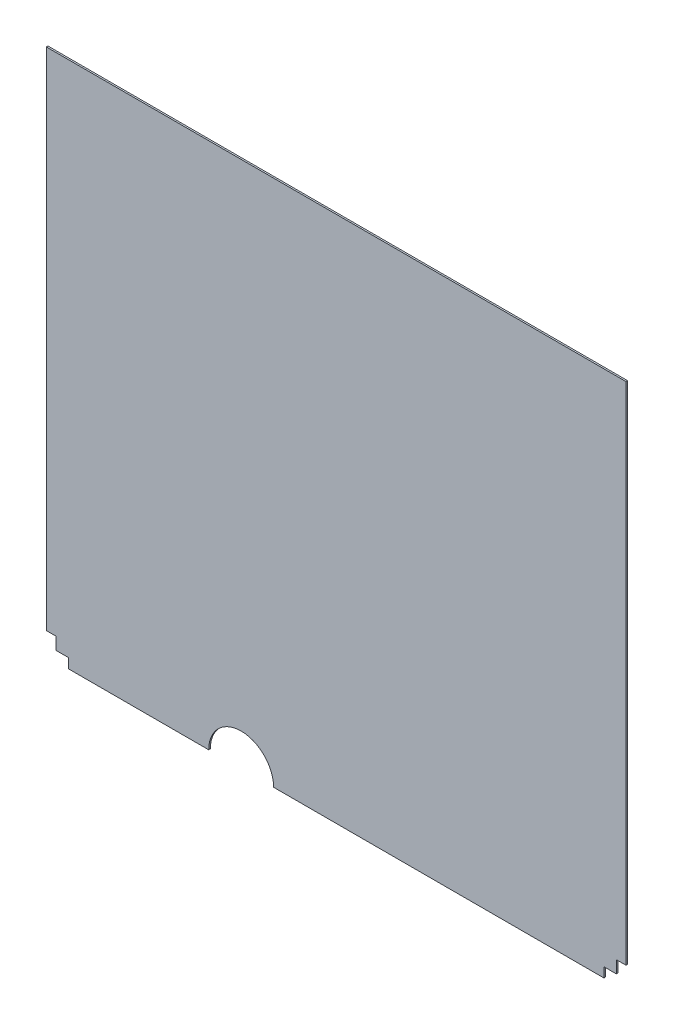
ISO-10303-21;
HEADER;
FILE_DESCRIPTION(('STEP AP214'),'2;1');
FILE_NAME('part.step','',(''),(''),'','','');
FILE_SCHEMA(('AUTOMOTIVE_DESIGN { 1 0 10303 214 1 1 1 1 }'));
ENDSEC;
DATA;
#1=APPLICATION_CONTEXT('core data for automotive mechanical design processes');
#2=APPLICATION_PROTOCOL_DEFINITION('international standard','automotive_design',2000,#1);
#3=PRODUCT_CONTEXT('',#1,'mechanical');
#4=PRODUCT('Part','Part','',(#3));
#5=PRODUCT_RELATED_PRODUCT_CATEGORY('part','',(#4));
#6=PRODUCT_DEFINITION_FORMATION('','',#4);
#7=PRODUCT_DEFINITION_CONTEXT('part definition',#1,'design');
#8=PRODUCT_DEFINITION('design','',#6,#7);
#9=PRODUCT_DEFINITION_SHAPE('','',#8);
#10=(LENGTH_UNIT() NAMED_UNIT(*) SI_UNIT(.MILLI.,.METRE.));
#11=(NAMED_UNIT(*) PLANE_ANGLE_UNIT() SI_UNIT($,.RADIAN.));
#12=(NAMED_UNIT(*) SI_UNIT($,.STERADIAN.) SOLID_ANGLE_UNIT());
#13=UNCERTAINTY_MEASURE_WITH_UNIT(LENGTH_MEASURE(1.E-05),#10,'distance_accuracy_value','');
#14=(GEOMETRIC_REPRESENTATION_CONTEXT(3) GLOBAL_UNCERTAINTY_ASSIGNED_CONTEXT((#13)) GLOBAL_UNIT_ASSIGNED_CONTEXT((#10,
#11,#12)) REPRESENTATION_CONTEXT('',''));
#15=CARTESIAN_POINT('',(0.,0.,0.));
#16=DIRECTION('',(0.,0.,1.));
#17=DIRECTION('',(1.,0.,0.));
#18=AXIS2_PLACEMENT_3D('',#15,#16,#17);
#19=CARTESIAN_POINT('',(304.8,0.,2.54));
#20=DIRECTION('',(0.,0.,-1.));
#21=DIRECTION('',(-1.,0.,0.));
#22=AXIS2_PLACEMENT_3D('',#19,#20,#21);
#23=CYLINDRICAL_SURFACE('',#22,50.8);
#24=CARTESIAN_POINT('',(304.8,0.,0.));
#25=DIRECTION('',(0.,0.,1.));
#26=DIRECTION('',(1.,0.,0.));
#27=AXIS2_PLACEMENT_3D('',#24,#25,#26);
#28=CIRCLE('',#27,50.8);
#29=CARTESIAN_POINT('',(355.6,0.,0.));
#30=VERTEX_POINT('',#29);
#31=CARTESIAN_POINT('',(254.,0.,0.));
#32=VERTEX_POINT('',#31);
#33=EDGE_CURVE('E182',#30,#32,#28,.T.);
#34=ORIENTED_EDGE('',*,*,#33,.F.);
#35=DIRECTION('',(0.,0.,-1.));
#36=VECTOR('',#35,1.);
#37=CARTESIAN_POINT('',(355.6,0.,2.54));
#38=LINE('',#37,#36);
#39=CARTESIAN_POINT('',(355.6,0.,2.54));
#40=VERTEX_POINT('',#39);
#41=EDGE_CURVE('E11',#40,#30,#38,.T.);
#42=ORIENTED_EDGE('',*,*,#41,.F.);
#43=CARTESIAN_POINT('',(304.8,0.,2.54));
#44=DIRECTION('',(0.,0.,1.));
#45=DIRECTION('',(1.,0.,0.));
#46=AXIS2_PLACEMENT_3D('',#43,#44,#45);
#47=CIRCLE('',#46,50.8);
#48=CARTESIAN_POINT('',(254.,0.,2.54));
#49=VERTEX_POINT('',#48);
#50=EDGE_CURVE('E287',#40,#49,#47,.T.);
#51=ORIENTED_EDGE('',*,*,#50,.T.);
#52=DIRECTION('',(0.,0.,-1.));
#53=VECTOR('',#52,1.);
#54=CARTESIAN_POINT('',(254.,0.,2.54));
#55=LINE('',#54,#53);
#56=EDGE_CURVE('E117',#49,#32,#55,.T.);
#57=ORIENTED_EDGE('',*,*,#56,.T.);
#58=EDGE_LOOP('',(#34,#42,#51,#57));
#59=FACE_BOUND('',#58,.T.);
#60=ADVANCED_FACE('F47',(#59),#23,.F.);
#61=CARTESIAN_POINT('',(0.,0.,2.54));
#62=DIRECTION('',(0.,1.,0.));
#63=DIRECTION('',(0.,0.,1.));
#64=AXIS2_PLACEMENT_3D('',#61,#62,#63);
#65=PLANE('',#64);
#66=DIRECTION('',(1.,0.,0.));
#67=VECTOR('',#66,1.);
#68=CARTESIAN_POINT('',(0.,0.,0.));
#69=LINE('',#68,#67);
#70=CARTESIAN_POINT('',(872.45698,0.,0.));
#71=VERTEX_POINT('',#70);
#72=EDGE_CURVE('E186',#30,#71,#69,.T.);
#73=ORIENTED_EDGE('',*,*,#72,.T.);
#74=DIRECTION('',(0.,0.,-1.));
#75=VECTOR('',#74,1.);
#76=CARTESIAN_POINT('',(872.45698,0.,2.54));
#77=LINE('',#76,#75);
#78=CARTESIAN_POINT('',(872.45698,0.,2.54));
#79=VERTEX_POINT('',#78);
#80=EDGE_CURVE('E56',#79,#71,#77,.T.);
#81=ORIENTED_EDGE('',*,*,#80,.F.);
#82=DIRECTION('',(1.,0.,0.));
#83=VECTOR('',#82,1.);
#84=CARTESIAN_POINT('',(0.,0.,2.54));
#85=LINE('',#84,#83);
#86=EDGE_CURVE('E179',#40,#79,#85,.T.);
#87=ORIENTED_EDGE('',*,*,#86,.F.);
#88=ORIENTED_EDGE('',*,*,#41,.T.);
#89=EDGE_LOOP('',(#73,#81,#87,#88));
#90=FACE_BOUND('',#89,.T.);
#91=ADVANCED_FACE('F269',(#90),#65,.F.);
#92=CARTESIAN_POINT('',(872.45698,0.,2.54));
#93=DIRECTION('',(1.,0.,0.));
#94=DIRECTION('',(0.,0.,-1.));
#95=AXIS2_PLACEMENT_3D('',#92,#93,#94);
#96=PLANE('',#95);
#97=DIRECTION('',(0.,-1.,0.));
#98=VECTOR('',#97,1.);
#99=CARTESIAN_POINT('',(872.45698,0.,0.));
#100=LINE('',#99,#98);
#101=CARTESIAN_POINT('',(872.45698,15.24,0.));
#102=VERTEX_POINT('',#101);
#103=EDGE_CURVE('E190',#102,#71,#100,.T.);
#104=ORIENTED_EDGE('',*,*,#103,.F.);
#105=DIRECTION('',(0.,0.,-1.));
#106=VECTOR('',#105,1.);
#107=CARTESIAN_POINT('',(872.45698,15.24,2.54));
#108=LINE('',#107,#106);
#109=CARTESIAN_POINT('',(872.45698,15.24,2.54));
#110=VERTEX_POINT('',#109);
#111=EDGE_CURVE('E257',#110,#102,#108,.T.);
#112=ORIENTED_EDGE('',*,*,#111,.F.);
#113=DIRECTION('',(0.,-1.,0.));
#114=VECTOR('',#113,1.);
#115=CARTESIAN_POINT('',(872.45698,0.,2.54));
#116=LINE('',#115,#114);
#117=EDGE_CURVE('E266',#110,#79,#116,.T.);
#118=ORIENTED_EDGE('',*,*,#117,.T.);
#119=ORIENTED_EDGE('',*,*,#80,.T.);
#120=EDGE_LOOP('',(#104,#112,#118,#119));
#121=FACE_BOUND('',#120,.T.);
#122=ADVANCED_FACE('F264',(#121),#96,.T.);
#123=CARTESIAN_POINT('',(0.,15.2399999999999,2.54));
#124=DIRECTION('',(0.,-1.,0.));
#125=DIRECTION('',(1.,0.,0.));
#126=AXIS2_PLACEMENT_3D('',#123,#124,#125);
#127=PLANE('',#126);
#128=DIRECTION('',(-1.,0.,0.));
#129=VECTOR('',#128,1.);
#130=CARTESIAN_POINT('',(0.,15.2399999999999,0.));
#131=LINE('',#130,#129);
#132=CARTESIAN_POINT('',(891.76098,15.24,0.));
#133=VERTEX_POINT('',#132);
#134=EDGE_CURVE('E195',#133,#102,#131,.T.);
#135=ORIENTED_EDGE('',*,*,#134,.F.);
#136=DIRECTION('',(0.,0.,-1.));
#137=VECTOR('',#136,1.);
#138=CARTESIAN_POINT('',(891.76098,15.24,2.54));
#139=LINE('',#138,#137);
#140=CARTESIAN_POINT('',(891.76098,15.24,2.54));
#141=VERTEX_POINT('',#140);
#142=EDGE_CURVE('E254',#141,#133,#139,.T.);
#143=ORIENTED_EDGE('',*,*,#142,.F.);
#144=DIRECTION('',(-1.,0.,0.));
#145=VECTOR('',#144,1.);
#146=CARTESIAN_POINT('',(0.,15.2399999999999,2.54));
#147=LINE('',#146,#145);
#148=EDGE_CURVE('E278',#141,#110,#147,.T.);
#149=ORIENTED_EDGE('',*,*,#148,.T.);
#150=ORIENTED_EDGE('',*,*,#111,.T.);
#151=EDGE_LOOP('',(#135,#143,#149,#150));
#152=FACE_BOUND('',#151,.T.);
#153=ADVANCED_FACE('F275',(#152),#127,.T.);
#154=CARTESIAN_POINT('',(891.76098,0.,2.54));
#155=DIRECTION('',(1.,0.,0.));
#156=DIRECTION('',(0.,0.,-1.));
#157=AXIS2_PLACEMENT_3D('',#154,#155,#156);
#158=PLANE('',#157);
#159=DIRECTION('',(0.,-1.,0.));
#160=VECTOR('',#159,1.);
#161=CARTESIAN_POINT('',(891.76098,0.,0.));
#162=LINE('',#161,#160);
#163=CARTESIAN_POINT('',(891.76098,34.544,0.));
#164=VERTEX_POINT('',#163);
#165=EDGE_CURVE('E199',#164,#133,#162,.T.);
#166=ORIENTED_EDGE('',*,*,#165,.F.);
#167=DIRECTION('',(0.,0.,-1.));
#168=VECTOR('',#167,1.);
#169=CARTESIAN_POINT('',(891.76098,34.544,2.54));
#170=LINE('',#169,#168);
#171=CARTESIAN_POINT('',(891.76098,34.544,2.54));
#172=VERTEX_POINT('',#171);
#173=EDGE_CURVE('E251',#172,#164,#170,.T.);
#174=ORIENTED_EDGE('',*,*,#173,.F.);
#175=DIRECTION('',(0.,-1.,0.));
#176=VECTOR('',#175,1.);
#177=CARTESIAN_POINT('',(891.76098,0.,2.54));
#178=LINE('',#177,#176);
#179=EDGE_CURVE('E285',#172,#141,#178,.T.);
#180=ORIENTED_EDGE('',*,*,#179,.T.);
#181=ORIENTED_EDGE('',*,*,#142,.T.);
#182=EDGE_LOOP('',(#166,#174,#180,#181));
#183=FACE_BOUND('',#182,.T.);
#184=ADVANCED_FACE('F365',(#183),#158,.T.);
#185=CARTESIAN_POINT('',(0.,34.5439999999996,2.54));
#186=DIRECTION('',(0.,-1.,0.));
#187=DIRECTION('',(1.,0.,0.));
#188=AXIS2_PLACEMENT_3D('',#185,#186,#187);
#189=PLANE('',#188);
#190=DIRECTION('',(-1.,0.,0.));
#191=VECTOR('',#190,1.);
#192=CARTESIAN_POINT('',(0.,34.5439999999996,0.));
#193=LINE('',#192,#191);
#194=CARTESIAN_POINT('',(907.00098,34.544,0.));
#195=VERTEX_POINT('',#194);
#196=EDGE_CURVE('E203',#195,#164,#193,.T.);
#197=ORIENTED_EDGE('',*,*,#196,.F.);
#198=DIRECTION('',(0.,0.,-1.));
#199=VECTOR('',#198,1.);
#200=CARTESIAN_POINT('',(907.00098,34.544,2.54));
#201=LINE('',#200,#199);
#202=CARTESIAN_POINT('',(907.00098,34.544,2.54));
#203=VERTEX_POINT('',#202);
#204=EDGE_CURVE('E248',#203,#195,#201,.T.);
#205=ORIENTED_EDGE('',*,*,#204,.F.);
#206=DIRECTION('',(-1.,0.,0.));
#207=VECTOR('',#206,1.);
#208=CARTESIAN_POINT('',(0.,34.5439999999996,2.54));
#209=LINE('',#208,#207);
#210=EDGE_CURVE('E292',#203,#172,#209,.T.);
#211=ORIENTED_EDGE('',*,*,#210,.T.);
#212=ORIENTED_EDGE('',*,*,#173,.T.);
#213=EDGE_LOOP('',(#197,#205,#211,#212));
#214=FACE_BOUND('',#213,.T.);
#215=ADVANCED_FACE('F361',(#214),#189,.T.);
#216=CARTESIAN_POINT('',(907.00098,0.,2.54));
#217=DIRECTION('',(-1.,0.,0.));
#218=DIRECTION('',(0.,0.,1.));
#219=AXIS2_PLACEMENT_3D('',#216,#217,#218);
#220=PLANE('',#219);
#221=DIRECTION('',(0.,1.,0.));
#222=VECTOR('',#221,1.);
#223=CARTESIAN_POINT('',(907.00098,0.,0.));
#224=LINE('',#223,#222);
#225=CARTESIAN_POINT('',(907.00098,825.5,0.));
#226=VERTEX_POINT('',#225);
#227=EDGE_CURVE('E207',#195,#226,#224,.T.);
#228=ORIENTED_EDGE('',*,*,#227,.T.);
#229=DIRECTION('',(0.,0.,-1.));
#230=VECTOR('',#229,1.);
#231=CARTESIAN_POINT('',(907.00098,825.5,2.54));
#232=LINE('',#231,#230);
#233=CARTESIAN_POINT('',(907.00098,825.5,2.54));
#234=VERTEX_POINT('',#233);
#235=EDGE_CURVE('E245',#234,#226,#232,.T.);
#236=ORIENTED_EDGE('',*,*,#235,.F.);
#237=DIRECTION('',(0.,1.,0.));
#238=VECTOR('',#237,1.);
#239=CARTESIAN_POINT('',(907.00098,0.,2.54));
#240=LINE('',#239,#238);
#241=EDGE_CURVE('E296',#203,#234,#240,.T.);
#242=ORIENTED_EDGE('',*,*,#241,.F.);
#243=ORIENTED_EDGE('',*,*,#204,.T.);
#244=EDGE_LOOP('',(#228,#236,#242,#243));
#245=FACE_BOUND('',#244,.T.);
#246=ADVANCED_FACE('F357',(#245),#220,.F.);
#247=CARTESIAN_POINT('',(0.,825.5,2.54));
#248=DIRECTION('',(0.,1.,0.));
#249=DIRECTION('',(0.,0.,1.));
#250=AXIS2_PLACEMENT_3D('',#247,#248,#249);
#251=PLANE('',#250);
#252=DIRECTION('',(1.,0.,0.));
#253=VECTOR('',#252,1.);
#254=CARTESIAN_POINT('',(0.,825.5,0.));
#255=LINE('',#254,#253);
#256=CARTESIAN_POINT('',(0.,825.5,0.));
#257=VERTEX_POINT('',#256);
#258=EDGE_CURVE('E211',#257,#226,#255,.T.);
#259=ORIENTED_EDGE('',*,*,#258,.F.);
#260=DIRECTION('',(0.,0.,-1.));
#261=VECTOR('',#260,1.);
#262=CARTESIAN_POINT('',(0.,825.5,2.54));
#263=LINE('',#262,#261);
#264=CARTESIAN_POINT('',(0.,825.5,2.54));
#265=VERTEX_POINT('',#264);
#266=EDGE_CURVE('E242',#265,#257,#263,.T.);
#267=ORIENTED_EDGE('',*,*,#266,.F.);
#268=DIRECTION('',(1.,0.,0.));
#269=VECTOR('',#268,1.);
#270=CARTESIAN_POINT('',(0.,825.5,2.54));
#271=LINE('',#270,#269);
#272=EDGE_CURVE('E299',#265,#234,#271,.T.);
#273=ORIENTED_EDGE('',*,*,#272,.T.);
#274=ORIENTED_EDGE('',*,*,#235,.T.);
#275=EDGE_LOOP('',(#259,#267,#273,#274));
#276=FACE_BOUND('',#275,.T.);
#277=ADVANCED_FACE('F353',(#276),#251,.T.);
#278=CARTESIAN_POINT('',(0.,0.,2.54));
#279=DIRECTION('',(-1.,0.,0.));
#280=DIRECTION('',(0.,0.,1.));
#281=AXIS2_PLACEMENT_3D('',#278,#279,#280);
#282=PLANE('',#281);
#283=DIRECTION('',(0.,1.,0.));
#284=VECTOR('',#283,1.);
#285=CARTESIAN_POINT('',(0.,0.,0.));
#286=LINE('',#285,#284);
#287=CARTESIAN_POINT('',(0.,34.544,0.));
#288=VERTEX_POINT('',#287);
#289=EDGE_CURVE('E215',#288,#257,#286,.T.);
#290=ORIENTED_EDGE('',*,*,#289,.F.);
#291=DIRECTION('',(0.,0.,-1.));
#292=VECTOR('',#291,1.);
#293=CARTESIAN_POINT('',(0.,34.544,2.54));
#294=LINE('',#293,#292);
#295=CARTESIAN_POINT('',(0.,34.544,2.54));
#296=VERTEX_POINT('',#295);
#297=EDGE_CURVE('E239',#296,#288,#294,.T.);
#298=ORIENTED_EDGE('',*,*,#297,.F.);
#299=DIRECTION('',(0.,1.,0.));
#300=VECTOR('',#299,1.);
#301=CARTESIAN_POINT('',(0.,0.,2.54));
#302=LINE('',#301,#300);
#303=EDGE_CURVE('E303',#296,#265,#302,.T.);
#304=ORIENTED_EDGE('',*,*,#303,.T.);
#305=ORIENTED_EDGE('',*,*,#266,.T.);
#306=EDGE_LOOP('',(#290,#298,#304,#305));
#307=FACE_BOUND('',#306,.T.);
#308=ADVANCED_FACE('F350',(#307),#282,.T.);
#309=CARTESIAN_POINT('',(0.,34.544,2.54));
#310=DIRECTION('',(0.,1.,0.));
#311=DIRECTION('',(0.,0.,1.));
#312=AXIS2_PLACEMENT_3D('',#309,#310,#311);
#313=PLANE('',#312);
#314=DIRECTION('',(1.,0.,0.));
#315=VECTOR('',#314,1.);
#316=CARTESIAN_POINT('',(0.,34.544,0.));
#317=LINE('',#316,#315);
#318=CARTESIAN_POINT('',(15.24,34.544,0.));
#319=VERTEX_POINT('',#318);
#320=EDGE_CURVE('E219',#288,#319,#317,.T.);
#321=ORIENTED_EDGE('',*,*,#320,.T.);
#322=DIRECTION('',(0.,0.,-1.));
#323=VECTOR('',#322,1.);
#324=CARTESIAN_POINT('',(15.24,34.544,2.54));
#325=LINE('',#324,#323);
#326=CARTESIAN_POINT('',(15.24,34.544,2.54));
#327=VERTEX_POINT('',#326);
#328=EDGE_CURVE('E235',#327,#319,#325,.T.);
#329=ORIENTED_EDGE('',*,*,#328,.F.);
#330=DIRECTION('',(1.,0.,0.));
#331=VECTOR('',#330,1.);
#332=CARTESIAN_POINT('',(0.,34.544,2.54));
#333=LINE('',#332,#331);
#334=EDGE_CURVE('E307',#296,#327,#333,.T.);
#335=ORIENTED_EDGE('',*,*,#334,.F.);
#336=ORIENTED_EDGE('',*,*,#297,.T.);
#337=EDGE_LOOP('',(#321,#329,#335,#336));
#338=FACE_BOUND('',#337,.T.);
#339=ADVANCED_FACE('F315',(#338),#313,.F.);
#340=CARTESIAN_POINT('',(15.24,0.,2.54));
#341=DIRECTION('',(1.,0.,0.));
#342=DIRECTION('',(0.,1.,0.));
#343=AXIS2_PLACEMENT_3D('',#340,#341,#342);
#344=PLANE('',#343);
#345=DIRECTION('',(0.,-1.,0.));
#346=VECTOR('',#345,1.);
#347=CARTESIAN_POINT('',(15.24,0.,0.));
#348=LINE('',#347,#346);
#349=CARTESIAN_POINT('',(15.24,15.24,0.));
#350=VERTEX_POINT('',#349);
#351=EDGE_CURVE('E222',#319,#350,#348,.T.);
#352=ORIENTED_EDGE('',*,*,#351,.T.);
#353=DIRECTION('',(0.,0.,-1.));
#354=VECTOR('',#353,1.);
#355=CARTESIAN_POINT('',(15.24,15.24,2.54));
#356=LINE('',#355,#354);
#357=CARTESIAN_POINT('',(15.24,15.24,2.54));
#358=VERTEX_POINT('',#357);
#359=EDGE_CURVE('E171',#358,#350,#356,.T.);
#360=ORIENTED_EDGE('',*,*,#359,.F.);
#361=DIRECTION('',(0.,-1.,0.));
#362=VECTOR('',#361,1.);
#363=CARTESIAN_POINT('',(15.24,0.,2.54));
#364=LINE('',#363,#362);
#365=EDGE_CURVE('E160',#327,#358,#364,.T.);
#366=ORIENTED_EDGE('',*,*,#365,.F.);
#367=ORIENTED_EDGE('',*,*,#328,.T.);
#368=EDGE_LOOP('',(#352,#360,#366,#367));
#369=FACE_BOUND('',#368,.T.);
#370=ADVANCED_FACE('F319',(#369),#344,.F.);
#371=CARTESIAN_POINT('',(0.,15.24,2.54));
#372=DIRECTION('',(0.,1.,0.));
#373=DIRECTION('',(0.,0.,1.));
#374=AXIS2_PLACEMENT_3D('',#371,#372,#373);
#375=PLANE('',#374);
#376=DIRECTION('',(1.,0.,0.));
#377=VECTOR('',#376,1.);
#378=CARTESIAN_POINT('',(0.,15.24,0.));
#379=LINE('',#378,#377);
#380=CARTESIAN_POINT('',(34.544,15.24,0.));
#381=VERTEX_POINT('',#380);
#382=EDGE_CURVE('E169',#350,#381,#379,.T.);
#383=ORIENTED_EDGE('',*,*,#382,.T.);
#384=DIRECTION('',(0.,0.,-1.));
#385=VECTOR('',#384,1.);
#386=CARTESIAN_POINT('',(34.544,15.24,2.54));
#387=LINE('',#386,#385);
#388=CARTESIAN_POINT('',(34.544,15.24,2.54));
#389=VERTEX_POINT('',#388);
#390=EDGE_CURVE('E166',#389,#381,#387,.T.);
#391=ORIENTED_EDGE('',*,*,#390,.F.);
#392=DIRECTION('',(1.,0.,0.));
#393=VECTOR('',#392,1.);
#394=CARTESIAN_POINT('',(0.,15.24,2.54));
#395=LINE('',#394,#393);
#396=EDGE_CURVE('E154',#358,#389,#395,.T.);
#397=ORIENTED_EDGE('',*,*,#396,.F.);
#398=ORIENTED_EDGE('',*,*,#359,.T.);
#399=EDGE_LOOP('',(#383,#391,#397,#398));
#400=FACE_BOUND('',#399,.T.);
#401=ADVANCED_FACE('F167',(#400),#375,.F.);
#402=CARTESIAN_POINT('',(34.544,0.,2.54));
#403=DIRECTION('',(1.,0.,0.));
#404=DIRECTION('',(0.,0.,-1.));
#405=AXIS2_PLACEMENT_3D('',#402,#403,#404);
#406=PLANE('',#405);
#407=DIRECTION('',(0.,-1.,0.));
#408=VECTOR('',#407,1.);
#409=CARTESIAN_POINT('',(34.544,0.,0.));
#410=LINE('',#409,#408);
#411=CARTESIAN_POINT('',(34.544,0.,0.));
#412=VERTEX_POINT('',#411);
#413=EDGE_CURVE('E110',#381,#412,#410,.T.);
#414=ORIENTED_EDGE('',*,*,#413,.T.);
#415=DIRECTION('',(0.,0.,-1.));
#416=VECTOR('',#415,1.);
#417=CARTESIAN_POINT('',(34.544,0.,2.54));
#418=LINE('',#417,#416);
#419=CARTESIAN_POINT('',(34.544,0.,2.54));
#420=VERTEX_POINT('',#419);
#421=EDGE_CURVE('E172',#420,#412,#418,.T.);
#422=ORIENTED_EDGE('',*,*,#421,.F.);
#423=DIRECTION('',(0.,-1.,0.));
#424=VECTOR('',#423,1.);
#425=CARTESIAN_POINT('',(34.544,0.,2.54));
#426=LINE('',#425,#424);
#427=EDGE_CURVE('E158',#389,#420,#426,.T.);
#428=ORIENTED_EDGE('',*,*,#427,.F.);
#429=ORIENTED_EDGE('',*,*,#390,.T.);
#430=EDGE_LOOP('',(#414,#422,#428,#429));
#431=FACE_BOUND('',#430,.T.);
#432=ADVANCED_FACE('F174',(#431),#406,.F.);
#433=EDGE_CURVE('E191',#412,#32,#69,.T.);
#434=ORIENTED_EDGE('',*,*,#433,.T.);
#435=ORIENTED_EDGE('',*,*,#56,.F.);
#436=EDGE_CURVE('E64',#420,#49,#85,.T.);
#437=ORIENTED_EDGE('',*,*,#436,.F.);
#438=ORIENTED_EDGE('',*,*,#421,.T.);
#439=EDGE_LOOP('',(#434,#435,#437,#438));
#440=FACE_BOUND('',#439,.T.);
#441=ADVANCED_FACE('F329',(#440),#65,.F.);
#442=CARTESIAN_POINT('',(0.,0.,2.54));
#443=DIRECTION('',(0.,0.,1.));
#444=DIRECTION('',(1.,0.,0.));
#445=AXIS2_PLACEMENT_3D('',#442,#443,#444);
#446=PLANE('',#445);
#447=ORIENTED_EDGE('',*,*,#50,.F.);
#448=ORIENTED_EDGE('',*,*,#86,.T.);
#449=ORIENTED_EDGE('',*,*,#117,.F.);
#450=ORIENTED_EDGE('',*,*,#148,.F.);
#451=ORIENTED_EDGE('',*,*,#179,.F.);
#452=ORIENTED_EDGE('',*,*,#210,.F.);
#453=ORIENTED_EDGE('',*,*,#241,.T.);
#454=ORIENTED_EDGE('',*,*,#272,.F.);
#455=ORIENTED_EDGE('',*,*,#303,.F.);
#456=ORIENTED_EDGE('',*,*,#334,.T.);
#457=ORIENTED_EDGE('',*,*,#365,.T.);
#458=ORIENTED_EDGE('',*,*,#396,.T.);
#459=ORIENTED_EDGE('',*,*,#427,.T.);
#460=ORIENTED_EDGE('',*,*,#436,.T.);
#461=EDGE_LOOP('',(#447,#448,#449,#450,#451,#452,#453,#454,#455,#456,#457,#458,#459,#460));
#462=FACE_BOUND('',#461,.T.);
#463=ADVANCED_FACE('F156',(#462),#446,.T.);
#464=CARTESIAN_POINT('',(0.,0.,0.));
#465=DIRECTION('',(0.,0.,1.));
#466=DIRECTION('',(1.,0.,0.));
#467=AXIS2_PLACEMENT_3D('',#464,#465,#466);
#468=PLANE('',#467);
#469=ORIENTED_EDGE('',*,*,#33,.T.);
#470=ORIENTED_EDGE('',*,*,#433,.F.);
#471=ORIENTED_EDGE('',*,*,#413,.F.);
#472=ORIENTED_EDGE('',*,*,#382,.F.);
#473=ORIENTED_EDGE('',*,*,#351,.F.);
#474=ORIENTED_EDGE('',*,*,#320,.F.);
#475=ORIENTED_EDGE('',*,*,#289,.T.);
#476=ORIENTED_EDGE('',*,*,#258,.T.);
#477=ORIENTED_EDGE('',*,*,#227,.F.);
#478=ORIENTED_EDGE('',*,*,#196,.T.);
#479=ORIENTED_EDGE('',*,*,#165,.T.);
#480=ORIENTED_EDGE('',*,*,#134,.T.);
#481=ORIENTED_EDGE('',*,*,#103,.T.);
#482=ORIENTED_EDGE('',*,*,#72,.F.);
#483=EDGE_LOOP('',(#469,#470,#471,#472,#473,#474,#475,#476,#477,#478,#479,#480,#481,#482));
#484=FACE_BOUND('',#483,.T.);
#485=ADVANCED_FACE('F271',(#484),#468,.F.);
#486=CLOSED_SHELL('',(#60,#91,#122,#153,#184,#215,#246,#277,#308,#339,#370,#401,#432,#441,#463,#485));
#487=MANIFOLD_SOLID_BREP('B2',#486);
#488=ADVANCED_BREP_SHAPE_REPRESENTATION('',(#18,#487),#14);
#489=SHAPE_DEFINITION_REPRESENTATION(#9,#488);
ENDSEC;
END-ISO-10303-21;
